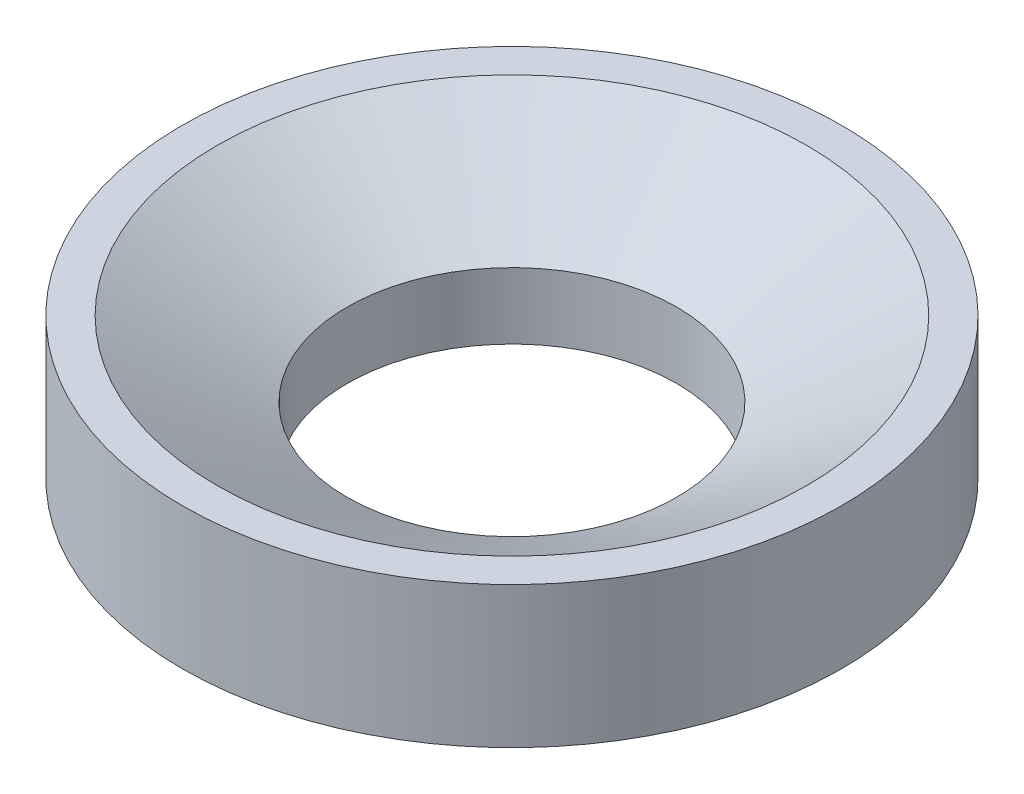
ISO-10303-21;
HEADER;
FILE_DESCRIPTION(('STEP AP214'),'2;1');
FILE_NAME('part.step','',(''),(''),'','','');
FILE_SCHEMA(('AUTOMOTIVE_DESIGN { 1 0 10303 214 1 1 1 1 }'));
ENDSEC;
DATA;
#1=APPLICATION_CONTEXT('core data for automotive mechanical design processes');
#2=APPLICATION_PROTOCOL_DEFINITION('international standard','automotive_design',2000,#1);
#3=PRODUCT_CONTEXT('',#1,'mechanical');
#4=PRODUCT('Part','Part','',(#3));
#5=PRODUCT_RELATED_PRODUCT_CATEGORY('part','',(#4));
#6=PRODUCT_DEFINITION_FORMATION('','',#4);
#7=PRODUCT_DEFINITION_CONTEXT('part definition',#1,'design');
#8=PRODUCT_DEFINITION('design','',#6,#7);
#9=PRODUCT_DEFINITION_SHAPE('','',#8);
#10=(LENGTH_UNIT() NAMED_UNIT(*) SI_UNIT(.MILLI.,.METRE.));
#11=(NAMED_UNIT(*) PLANE_ANGLE_UNIT() SI_UNIT($,.RADIAN.));
#12=(NAMED_UNIT(*) SI_UNIT($,.STERADIAN.) SOLID_ANGLE_UNIT());
#13=UNCERTAINTY_MEASURE_WITH_UNIT(LENGTH_MEASURE(1.E-05),#10,'distance_accuracy_value','');
#14=(GEOMETRIC_REPRESENTATION_CONTEXT(3) GLOBAL_UNCERTAINTY_ASSIGNED_CONTEXT((#13)) GLOBAL_UNIT_ASSIGNED_CONTEXT((#10,
#11,#12)) REPRESENTATION_CONTEXT('',''));
#15=CARTESIAN_POINT('',(0.,0.,0.));
#16=DIRECTION('',(0.,0.,1.));
#17=DIRECTION('',(1.,0.,0.));
#18=AXIS2_PLACEMENT_3D('',#15,#16,#17);
#19=CARTESIAN_POINT('',(0.,44.6684275184275,0.));
#20=DIRECTION('',(0.,1.,0.));
#21=DIRECTION('',(0.,0.,1.));
#22=AXIS2_PLACEMENT_3D('',#19,#20,#21);
#23=CYLINDRICAL_SURFACE('',#22,44.45);
#24=CARTESIAN_POINT('',(0.,0.,0.));
#25=DIRECTION('',(0.,1.,0.));
#26=DIRECTION('',(0.,0.,1.));
#27=AXIS2_PLACEMENT_3D('',#24,#25,#26);
#28=CIRCLE('',#27,44.45);
#29=CARTESIAN_POINT('',(0.,0.,44.45));
#30=VERTEX_POINT('',#29);
#31=EDGE_CURVE('E50',#30,#30,#28,.T.);
#32=ORIENTED_EDGE('',*,*,#31,.F.);
#33=EDGE_LOOP('',(#32));
#34=FACE_BOUND('',#33,.T.);
#35=CARTESIAN_POINT('',(0.,17.8594755567107,0.));
#36=DIRECTION('',(0.,1.,0.));
#37=DIRECTION('',(0.,0.,1.));
#38=AXIS2_PLACEMENT_3D('',#35,#36,#37);
#39=CIRCLE('',#38,44.45);
#40=CARTESIAN_POINT('',(0.,17.8594755567107,44.45));
#41=VERTEX_POINT('',#40);
#42=EDGE_CURVE('E10',#41,#41,#39,.T.);
#43=ORIENTED_EDGE('',*,*,#42,.T.);
#44=EDGE_LOOP('',(#43));
#45=FACE_BOUND('',#44,.T.);
#46=ADVANCED_FACE('F31',(#34,#45),#23,.F.);
#47=CARTESIAN_POINT('',(0.,38.1,0.));
#48=DIRECTION('',(0.,1.,0.));
#49=DIRECTION('',(0.,0.,1.));
#50=AXIS2_PLACEMENT_3D('',#47,#48,#49);
#51=CONICAL_SURFACE('',#50,79.5076167076167,1.0471975511966);
#52=ORIENTED_EDGE('',*,*,#42,.F.);
#53=EDGE_LOOP('',(#52));
#54=FACE_BOUND('',#53,.T.);
#55=CARTESIAN_POINT('',(0.,38.1,0.));
#56=DIRECTION('',(0.,1.,0.));
#57=DIRECTION('',(0.,0.,1.));
#58=AXIS2_PLACEMENT_3D('',#55,#56,#57);
#59=CIRCLE('',#58,79.5076167076167);
#60=CARTESIAN_POINT('',(0.,38.1,79.5076167076167));
#61=VERTEX_POINT('',#60);
#62=EDGE_CURVE('E37',#61,#61,#59,.T.);
#63=ORIENTED_EDGE('',*,*,#62,.T.);
#64=EDGE_LOOP('',(#63));
#65=FACE_BOUND('',#64,.T.);
#66=ADVANCED_FACE('F57',(#54,#65),#51,.F.);
#67=CARTESIAN_POINT('',(79.5076167076167,38.1,0.));
#68=DIRECTION('',(0.,-1.,0.));
#69=DIRECTION('',(0.,0.,-1.));
#70=AXIS2_PLACEMENT_3D('',#67,#68,#69);
#71=PLANE('',#70);
#72=ORIENTED_EDGE('',*,*,#62,.F.);
#73=EDGE_LOOP('',(#72));
#74=FACE_BOUND('',#73,.T.);
#75=CARTESIAN_POINT('',(0.,38.1,0.));
#76=DIRECTION('',(0.,1.,0.));
#77=DIRECTION('',(0.,0.,1.));
#78=AXIS2_PLACEMENT_3D('',#75,#76,#77);
#79=CIRCLE('',#78,88.9);
#80=CARTESIAN_POINT('',(0.,38.1,88.9));
#81=VERTEX_POINT('',#80);
#82=EDGE_CURVE('E41',#81,#81,#79,.T.);
#83=ORIENTED_EDGE('',*,*,#82,.T.);
#84=EDGE_LOOP('',(#83));
#85=FACE_BOUND('',#84,.T.);
#86=ADVANCED_FACE('F61',(#74,#85),#71,.F.);
#87=CARTESIAN_POINT('',(0.,44.6684275184275,0.));
#88=DIRECTION('',(0.,1.,0.));
#89=DIRECTION('',(0.,0.,1.));
#90=AXIS2_PLACEMENT_3D('',#87,#88,#89);
#91=CYLINDRICAL_SURFACE('',#90,88.9);
#92=ORIENTED_EDGE('',*,*,#82,.F.);
#93=EDGE_LOOP('',(#92));
#94=FACE_BOUND('',#93,.T.);
#95=CARTESIAN_POINT('',(0.,0.,0.));
#96=DIRECTION('',(0.,1.,0.));
#97=DIRECTION('',(0.,0.,1.));
#98=AXIS2_PLACEMENT_3D('',#95,#96,#97);
#99=CIRCLE('',#98,88.9);
#100=CARTESIAN_POINT('',(0.,0.,88.9));
#101=VERTEX_POINT('',#100);
#102=EDGE_CURVE('E45',#101,#101,#99,.T.);
#103=ORIENTED_EDGE('',*,*,#102,.T.);
#104=EDGE_LOOP('',(#103));
#105=FACE_BOUND('',#104,.T.);
#106=ADVANCED_FACE('F66',(#94,#105),#91,.T.);
#107=CARTESIAN_POINT('',(44.45,0.,0.));
#108=DIRECTION('',(0.,1.,0.));
#109=DIRECTION('',(0.,0.,1.));
#110=AXIS2_PLACEMENT_3D('',#107,#108,#109);
#111=PLANE('',#110);
#112=ORIENTED_EDGE('',*,*,#102,.F.);
#113=EDGE_LOOP('',(#112));
#114=FACE_BOUND('',#113,.T.);
#115=ORIENTED_EDGE('',*,*,#31,.T.);
#116=EDGE_LOOP('',(#115));
#117=FACE_BOUND('',#116,.T.);
#118=ADVANCED_FACE('F54',(#114,#117),#111,.F.);
#119=CLOSED_SHELL('',(#46,#66,#86,#106,#118));
#120=MANIFOLD_SOLID_BREP('B2',#119);
#121=ADVANCED_BREP_SHAPE_REPRESENTATION('',(#18,#120),#14);
#122=SHAPE_DEFINITION_REPRESENTATION(#9,#121);
ENDSEC;
END-ISO-10303-21;
